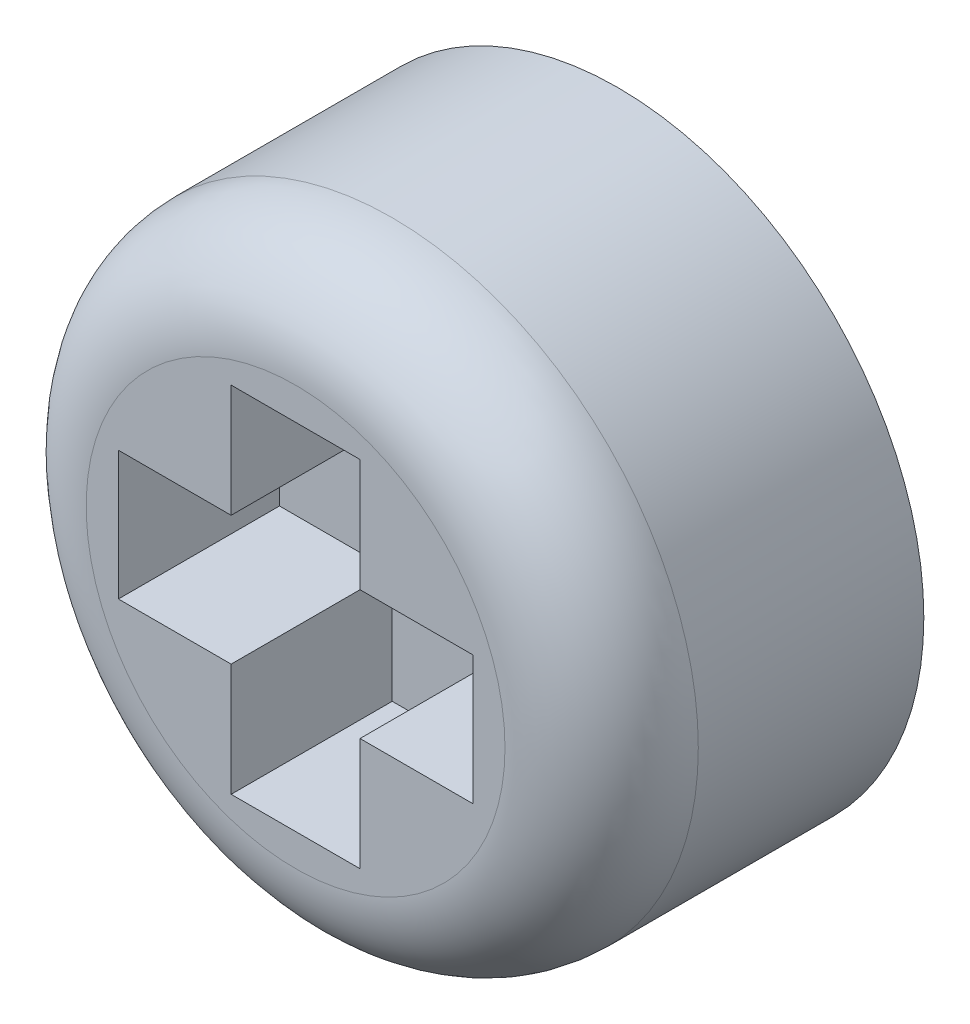
ISO-10303-21;
HEADER;
FILE_DESCRIPTION(('STEP AP214'),'2;1');
FILE_NAME('part.step','',(''),(''),'','','');
FILE_SCHEMA(('AUTOMOTIVE_DESIGN { 1 0 10303 214 1 1 1 1 }'));
ENDSEC;
DATA;
#1=APPLICATION_CONTEXT('core data for automotive mechanical design processes');
#2=APPLICATION_PROTOCOL_DEFINITION('international standard','automotive_design',2000,#1);
#3=PRODUCT_CONTEXT('',#1,'mechanical');
#4=PRODUCT('Part','Part','',(#3));
#5=PRODUCT_RELATED_PRODUCT_CATEGORY('part','',(#4));
#6=PRODUCT_DEFINITION_FORMATION('','',#4);
#7=PRODUCT_DEFINITION_CONTEXT('part definition',#1,'design');
#8=PRODUCT_DEFINITION('design','',#6,#7);
#9=PRODUCT_DEFINITION_SHAPE('','',#8);
#10=(LENGTH_UNIT() NAMED_UNIT(*) SI_UNIT(.MILLI.,.METRE.));
#11=(NAMED_UNIT(*) PLANE_ANGLE_UNIT() SI_UNIT($,.RADIAN.));
#12=(NAMED_UNIT(*) SI_UNIT($,.STERADIAN.) SOLID_ANGLE_UNIT());
#13=UNCERTAINTY_MEASURE_WITH_UNIT(LENGTH_MEASURE(1.E-05),#10,'distance_accuracy_value','');
#14=(GEOMETRIC_REPRESENTATION_CONTEXT(3) GLOBAL_UNCERTAINTY_ASSIGNED_CONTEXT((#13)) GLOBAL_UNIT_ASSIGNED_CONTEXT((#10,
#11,#12)) REPRESENTATION_CONTEXT('',''));
#15=CARTESIAN_POINT('',(0.,0.,0.));
#16=DIRECTION('',(0.,0.,1.));
#17=DIRECTION('',(1.,0.,0.));
#18=AXIS2_PLACEMENT_3D('',#15,#16,#17);
#19=CARTESIAN_POINT('',(0.,0.,2.54));
#20=DIRECTION('',(0.,0.,-1.));
#21=DIRECTION('',(-1.,0.,0.));
#22=AXIS2_PLACEMENT_3D('',#19,#20,#21);
#23=CYLINDRICAL_SURFACE('',#22,2.413);
#24=CARTESIAN_POINT('',(0.,0.,1.778));
#25=DIRECTION('',(0.,0.,1.));
#26=DIRECTION('',(1.,0.,0.));
#27=AXIS2_PLACEMENT_3D('',#24,#25,#26);
#28=CIRCLE('',#27,2.413);
#29=CARTESIAN_POINT('',(2.413,0.,1.778));
#30=VERTEX_POINT('',#29);
#31=EDGE_CURVE('E11',#30,#30,#28,.F.);
#32=ORIENTED_EDGE('',*,*,#31,.T.);
#33=EDGE_LOOP('',(#32));
#34=FACE_BOUND('',#33,.T.);
#35=CARTESIAN_POINT('',(0.,0.,0.));
#36=DIRECTION('',(0.,0.,1.));
#37=DIRECTION('',(1.,0.,0.));
#38=AXIS2_PLACEMENT_3D('',#35,#36,#37);
#39=CIRCLE('',#38,2.413);
#40=CARTESIAN_POINT('',(2.413,0.,0.));
#41=VERTEX_POINT('',#40);
#42=EDGE_CURVE('E188',#41,#41,#39,.T.);
#43=ORIENTED_EDGE('',*,*,#42,.T.);
#44=EDGE_LOOP('',(#43));
#45=FACE_BOUND('',#44,.T.);
#46=ADVANCED_FACE('F32',(#34,#45),#23,.T.);
#47=CARTESIAN_POINT('',(0.,0.,2.54));
#48=DIRECTION('',(0.,0.,1.));
#49=DIRECTION('',(1.,0.,0.));
#50=AXIS2_PLACEMENT_3D('',#47,#48,#49);
#51=PLANE('',#50);
#52=CARTESIAN_POINT('',(0.,0.,2.54));
#53=DIRECTION('',(0.,0.,1.));
#54=DIRECTION('',(1.,0.,0.));
#55=AXIS2_PLACEMENT_3D('',#52,#53,#54);
#56=CIRCLE('',#55,1.651);
#57=CARTESIAN_POINT('',(1.651,0.,2.54));
#58=VERTEX_POINT('',#57);
#59=EDGE_CURVE('E40',#58,#58,#56,.T.);
#60=ORIENTED_EDGE('',*,*,#59,.T.);
#61=EDGE_LOOP('',(#60));
#62=FACE_BOUND('',#61,.T.);
#63=DIRECTION('',(0.,-1.,0.));
#64=VECTOR('',#63,1.);
#65=CARTESIAN_POINT('',(-0.508,-1.397,2.54));
#66=LINE('',#65,#64);
#67=CARTESIAN_POINT('',(-0.508,-0.508,2.54));
#68=VERTEX_POINT('',#67);
#69=CARTESIAN_POINT('',(-0.508,-1.397,2.54));
#70=VERTEX_POINT('',#69);
#71=EDGE_CURVE('E47',#68,#70,#66,.T.);
#72=ORIENTED_EDGE('',*,*,#71,.F.);
#73=DIRECTION('',(1.,0.,0.));
#74=VECTOR('',#73,1.);
#75=CARTESIAN_POINT('',(-1.397,-0.508,2.54));
#76=LINE('',#75,#74);
#77=CARTESIAN_POINT('',(-1.397,-0.508,2.54));
#78=VERTEX_POINT('',#77);
#79=EDGE_CURVE('E184',#78,#68,#76,.T.);
#80=ORIENTED_EDGE('',*,*,#79,.F.);
#81=DIRECTION('',(0.,-1.,0.));
#82=VECTOR('',#81,1.);
#83=CARTESIAN_POINT('',(-1.397,-0.508,2.54));
#84=LINE('',#83,#82);
#85=CARTESIAN_POINT('',(-1.397,0.508,2.54));
#86=VERTEX_POINT('',#85);
#87=EDGE_CURVE('E182',#86,#78,#84,.T.);
#88=ORIENTED_EDGE('',*,*,#87,.F.);
#89=DIRECTION('',(-1.,0.,0.));
#90=VECTOR('',#89,1.);
#91=CARTESIAN_POINT('',(-1.397,0.508,2.54));
#92=LINE('',#91,#90);
#93=CARTESIAN_POINT('',(-0.508,0.508,2.54));
#94=VERTEX_POINT('',#93);
#95=EDGE_CURVE('E131',#94,#86,#92,.T.);
#96=ORIENTED_EDGE('',*,*,#95,.F.);
#97=DIRECTION('',(0.,-1.,0.));
#98=VECTOR('',#97,1.);
#99=CARTESIAN_POINT('',(-0.508,0.508,2.54));
#100=LINE('',#99,#98);
#101=CARTESIAN_POINT('',(-0.508,1.397,2.54));
#102=VERTEX_POINT('',#101);
#103=EDGE_CURVE('E178',#102,#94,#100,.T.);
#104=ORIENTED_EDGE('',*,*,#103,.F.);
#105=DIRECTION('',(-1.,0.,0.));
#106=VECTOR('',#105,1.);
#107=CARTESIAN_POINT('',(0.508,1.397,2.54));
#108=LINE('',#107,#106);
#109=CARTESIAN_POINT('',(0.508,1.397,2.54));
#110=VERTEX_POINT('',#109);
#111=EDGE_CURVE('E175',#110,#102,#108,.T.);
#112=ORIENTED_EDGE('',*,*,#111,.F.);
#113=DIRECTION('',(0.,1.,0.));
#114=VECTOR('',#113,1.);
#115=CARTESIAN_POINT('',(0.508,0.508,2.54));
#116=LINE('',#115,#114);
#117=CARTESIAN_POINT('',(0.508,0.508,2.54));
#118=VERTEX_POINT('',#117);
#119=EDGE_CURVE('E172',#118,#110,#116,.T.);
#120=ORIENTED_EDGE('',*,*,#119,.F.);
#121=DIRECTION('',(-1.,0.,0.));
#122=VECTOR('',#121,1.);
#123=CARTESIAN_POINT('',(0.508,0.508,2.54));
#124=LINE('',#123,#122);
#125=CARTESIAN_POINT('',(1.397,0.508,2.54));
#126=VERTEX_POINT('',#125);
#127=EDGE_CURVE('E169',#126,#118,#124,.T.);
#128=ORIENTED_EDGE('',*,*,#127,.F.);
#129=DIRECTION('',(0.,1.,0.));
#130=VECTOR('',#129,1.);
#131=CARTESIAN_POINT('',(1.397,-0.508,2.54));
#132=LINE('',#131,#130);
#133=CARTESIAN_POINT('',(1.397,-0.508,2.54));
#134=VERTEX_POINT('',#133);
#135=EDGE_CURVE('E166',#134,#126,#132,.T.);
#136=ORIENTED_EDGE('',*,*,#135,.F.);
#137=DIRECTION('',(1.,0.,0.));
#138=VECTOR('',#137,1.);
#139=CARTESIAN_POINT('',(0.508,-0.508,2.54));
#140=LINE('',#139,#138);
#141=CARTESIAN_POINT('',(0.508,-0.508,2.54));
#142=VERTEX_POINT('',#141);
#143=EDGE_CURVE('E163',#142,#134,#140,.T.);
#144=ORIENTED_EDGE('',*,*,#143,.F.);
#145=DIRECTION('',(0.,1.,0.));
#146=VECTOR('',#145,1.);
#147=CARTESIAN_POINT('',(0.508,-1.397,2.54));
#148=LINE('',#147,#146);
#149=CARTESIAN_POINT('',(0.508,-1.397,2.54));
#150=VERTEX_POINT('',#149);
#151=EDGE_CURVE('E160',#150,#142,#148,.T.);
#152=ORIENTED_EDGE('',*,*,#151,.F.);
#153=DIRECTION('',(1.,0.,0.));
#154=VECTOR('',#153,1.);
#155=CARTESIAN_POINT('',(-0.508,-1.397,2.54));
#156=LINE('',#155,#154);
#157=EDGE_CURVE('E157',#70,#150,#156,.T.);
#158=ORIENTED_EDGE('',*,*,#157,.F.);
#159=EDGE_LOOP('',(#72,#80,#88,#96,#104,#112,#120,#128,#136,#144,#152,#158));
#160=FACE_BOUND('',#159,.T.);
#161=ADVANCED_FACE('F210',(#62,#160),#51,.T.);
#162=CARTESIAN_POINT('',(0.,0.,0.));
#163=DIRECTION('',(0.,0.,1.));
#164=DIRECTION('',(1.,0.,0.));
#165=AXIS2_PLACEMENT_3D('',#162,#163,#164);
#166=PLANE('',#165);
#167=ORIENTED_EDGE('',*,*,#42,.F.);
#168=EDGE_LOOP('',(#167));
#169=FACE_BOUND('',#168,.T.);
#170=ADVANCED_FACE('F226',(#169),#166,.F.);
#171=CARTESIAN_POINT('',(-0.508,-1.397,1.27));
#172=DIRECTION('',(-1.,0.,0.));
#173=DIRECTION('',(0.,0.,1.));
#174=AXIS2_PLACEMENT_3D('',#171,#172,#173);
#175=PLANE('',#174);
#176=ORIENTED_EDGE('',*,*,#71,.T.);
#177=DIRECTION('',(0.,0.,1.));
#178=VECTOR('',#177,1.);
#179=CARTESIAN_POINT('',(-0.508,-1.397,1.27));
#180=LINE('',#179,#178);
#181=CARTESIAN_POINT('',(-0.508,-1.397,1.27));
#182=VERTEX_POINT('',#181);
#183=EDGE_CURVE('E95',#182,#70,#180,.T.);
#184=ORIENTED_EDGE('',*,*,#183,.F.);
#185=DIRECTION('',(0.,-1.,0.));
#186=VECTOR('',#185,1.);
#187=CARTESIAN_POINT('',(-0.508,-1.397,1.27));
#188=LINE('',#187,#186);
#189=CARTESIAN_POINT('',(-0.508,-0.508,1.27));
#190=VERTEX_POINT('',#189);
#191=EDGE_CURVE('E186',#190,#182,#188,.T.);
#192=ORIENTED_EDGE('',*,*,#191,.F.);
#193=DIRECTION('',(0.,0.,1.));
#194=VECTOR('',#193,1.);
#195=CARTESIAN_POINT('',(-0.508,-0.508,1.27));
#196=LINE('',#195,#194);
#197=EDGE_CURVE('E55',#190,#68,#196,.T.);
#198=ORIENTED_EDGE('',*,*,#197,.T.);
#199=EDGE_LOOP('',(#176,#184,#192,#198));
#200=FACE_BOUND('',#199,.T.);
#201=ADVANCED_FACE('F231',(#200),#175,.F.);
#202=CARTESIAN_POINT('',(-1.397,-0.508,1.27));
#203=DIRECTION('',(0.,-1.,0.));
#204=DIRECTION('',(0.,0.,-1.));
#205=AXIS2_PLACEMENT_3D('',#202,#203,#204);
#206=PLANE('',#205);
#207=ORIENTED_EDGE('',*,*,#79,.T.);
#208=ORIENTED_EDGE('',*,*,#197,.F.);
#209=DIRECTION('',(1.,0.,0.));
#210=VECTOR('',#209,1.);
#211=CARTESIAN_POINT('',(-1.397,-0.508,1.27));
#212=LINE('',#211,#210);
#213=CARTESIAN_POINT('',(-1.397,-0.508,1.27));
#214=VERTEX_POINT('',#213);
#215=EDGE_CURVE('E143',#214,#190,#212,.T.);
#216=ORIENTED_EDGE('',*,*,#215,.F.);
#217=DIRECTION('',(0.,0.,1.));
#218=VECTOR('',#217,1.);
#219=CARTESIAN_POINT('',(-1.397,-0.508,1.27));
#220=LINE('',#219,#218);
#221=EDGE_CURVE('E135',#214,#78,#220,.T.);
#222=ORIENTED_EDGE('',*,*,#221,.T.);
#223=EDGE_LOOP('',(#207,#208,#216,#222));
#224=FACE_BOUND('',#223,.T.);
#225=ADVANCED_FACE('F236',(#224),#206,.F.);
#226=CARTESIAN_POINT('',(-1.397,-0.508,1.27));
#227=DIRECTION('',(-1.,0.,0.));
#228=DIRECTION('',(0.,0.,1.));
#229=AXIS2_PLACEMENT_3D('',#226,#227,#228);
#230=PLANE('',#229);
#231=ORIENTED_EDGE('',*,*,#87,.T.);
#232=ORIENTED_EDGE('',*,*,#221,.F.);
#233=DIRECTION('',(0.,-1.,0.));
#234=VECTOR('',#233,1.);
#235=CARTESIAN_POINT('',(-1.397,-0.508,1.27));
#236=LINE('',#235,#234);
#237=CARTESIAN_POINT('',(-1.397,0.508,1.27));
#238=VERTEX_POINT('',#237);
#239=EDGE_CURVE('E139',#238,#214,#236,.T.);
#240=ORIENTED_EDGE('',*,*,#239,.F.);
#241=DIRECTION('',(0.,0.,1.));
#242=VECTOR('',#241,1.);
#243=CARTESIAN_POINT('',(-1.397,0.508,1.27));
#244=LINE('',#243,#242);
#245=EDGE_CURVE('E124',#238,#86,#244,.T.);
#246=ORIENTED_EDGE('',*,*,#245,.T.);
#247=EDGE_LOOP('',(#231,#232,#240,#246));
#248=FACE_BOUND('',#247,.T.);
#249=ADVANCED_FACE('F140',(#248),#230,.F.);
#250=CARTESIAN_POINT('',(-1.397,0.508,1.27));
#251=DIRECTION('',(0.,1.,0.));
#252=DIRECTION('',(0.,0.,1.));
#253=AXIS2_PLACEMENT_3D('',#250,#251,#252);
#254=PLANE('',#253);
#255=ORIENTED_EDGE('',*,*,#95,.T.);
#256=ORIENTED_EDGE('',*,*,#245,.F.);
#257=DIRECTION('',(-1.,0.,0.));
#258=VECTOR('',#257,1.);
#259=CARTESIAN_POINT('',(-1.397,0.508,1.27));
#260=LINE('',#259,#258);
#261=CARTESIAN_POINT('',(-0.508,0.508,1.27));
#262=VERTEX_POINT('',#261);
#263=EDGE_CURVE('E128',#262,#238,#260,.T.);
#264=ORIENTED_EDGE('',*,*,#263,.F.);
#265=DIRECTION('',(0.,0.,1.));
#266=VECTOR('',#265,1.);
#267=CARTESIAN_POINT('',(-0.508,0.508,1.27));
#268=LINE('',#267,#266);
#269=EDGE_CURVE('E136',#262,#94,#268,.T.);
#270=ORIENTED_EDGE('',*,*,#269,.T.);
#271=EDGE_LOOP('',(#255,#256,#264,#270));
#272=FACE_BOUND('',#271,.T.);
#273=ADVANCED_FACE('F126',(#272),#254,.F.);
#274=CARTESIAN_POINT('',(-0.508,0.508,1.27));
#275=DIRECTION('',(-1.,0.,0.));
#276=DIRECTION('',(0.,0.,1.));
#277=AXIS2_PLACEMENT_3D('',#274,#275,#276);
#278=PLANE('',#277);
#279=ORIENTED_EDGE('',*,*,#103,.T.);
#280=ORIENTED_EDGE('',*,*,#269,.F.);
#281=DIRECTION('',(0.,-1.,0.));
#282=VECTOR('',#281,1.);
#283=CARTESIAN_POINT('',(-0.508,0.508,1.27));
#284=LINE('',#283,#282);
#285=CARTESIAN_POINT('',(-0.508,1.397,1.27));
#286=VERTEX_POINT('',#285);
#287=EDGE_CURVE('E149',#286,#262,#284,.T.);
#288=ORIENTED_EDGE('',*,*,#287,.F.);
#289=DIRECTION('',(0.,0.,1.));
#290=VECTOR('',#289,1.);
#291=CARTESIAN_POINT('',(-0.508,1.397,1.27));
#292=LINE('',#291,#290);
#293=EDGE_CURVE('E191',#286,#102,#292,.T.);
#294=ORIENTED_EDGE('',*,*,#293,.T.);
#295=EDGE_LOOP('',(#279,#280,#288,#294));
#296=FACE_BOUND('',#295,.T.);
#297=ADVANCED_FACE('F263',(#296),#278,.F.);
#298=CARTESIAN_POINT('',(0.508,1.397,1.27));
#299=DIRECTION('',(0.,1.,0.));
#300=DIRECTION('',(0.,0.,1.));
#301=AXIS2_PLACEMENT_3D('',#298,#299,#300);
#302=PLANE('',#301);
#303=ORIENTED_EDGE('',*,*,#111,.T.);
#304=ORIENTED_EDGE('',*,*,#293,.F.);
#305=DIRECTION('',(-1.,0.,0.));
#306=VECTOR('',#305,1.);
#307=CARTESIAN_POINT('',(0.508,1.397,1.27));
#308=LINE('',#307,#306);
#309=CARTESIAN_POINT('',(0.508,1.397,1.27));
#310=VERTEX_POINT('',#309);
#311=EDGE_CURVE('E151',#310,#286,#308,.T.);
#312=ORIENTED_EDGE('',*,*,#311,.F.);
#313=DIRECTION('',(0.,0.,1.));
#314=VECTOR('',#313,1.);
#315=CARTESIAN_POINT('',(0.508,1.397,1.27));
#316=LINE('',#315,#314);
#317=EDGE_CURVE('E193',#310,#110,#316,.T.);
#318=ORIENTED_EDGE('',*,*,#317,.T.);
#319=EDGE_LOOP('',(#303,#304,#312,#318));
#320=FACE_BOUND('',#319,.T.);
#321=ADVANCED_FACE('F259',(#320),#302,.F.);
#322=CARTESIAN_POINT('',(0.508,0.508,1.27));
#323=DIRECTION('',(1.,0.,0.));
#324=DIRECTION('',(0.,0.,-1.));
#325=AXIS2_PLACEMENT_3D('',#322,#323,#324);
#326=PLANE('',#325);
#327=ORIENTED_EDGE('',*,*,#119,.T.);
#328=ORIENTED_EDGE('',*,*,#317,.F.);
#329=DIRECTION('',(0.,1.,0.));
#330=VECTOR('',#329,1.);
#331=CARTESIAN_POINT('',(0.508,0.508,1.27));
#332=LINE('',#331,#330);
#333=CARTESIAN_POINT('',(0.508,0.508,1.27));
#334=VERTEX_POINT('',#333);
#335=EDGE_CURVE('E297',#334,#310,#332,.T.);
#336=ORIENTED_EDGE('',*,*,#335,.F.);
#337=DIRECTION('',(0.,0.,1.));
#338=VECTOR('',#337,1.);
#339=CARTESIAN_POINT('',(0.508,0.508,1.27));
#340=LINE('',#339,#338);
#341=EDGE_CURVE('E195',#334,#118,#340,.T.);
#342=ORIENTED_EDGE('',*,*,#341,.T.);
#343=EDGE_LOOP('',(#327,#328,#336,#342));
#344=FACE_BOUND('',#343,.T.);
#345=ADVANCED_FACE('F255',(#344),#326,.F.);
#346=CARTESIAN_POINT('',(0.508,0.508,1.27));
#347=DIRECTION('',(0.,1.,0.));
#348=DIRECTION('',(0.,0.,1.));
#349=AXIS2_PLACEMENT_3D('',#346,#347,#348);
#350=PLANE('',#349);
#351=ORIENTED_EDGE('',*,*,#127,.T.);
#352=ORIENTED_EDGE('',*,*,#341,.F.);
#353=DIRECTION('',(-1.,0.,0.));
#354=VECTOR('',#353,1.);
#355=CARTESIAN_POINT('',(0.508,0.508,1.27));
#356=LINE('',#355,#354);
#357=CARTESIAN_POINT('',(1.397,0.508,1.27));
#358=VERTEX_POINT('',#357);
#359=EDGE_CURVE('E294',#358,#334,#356,.T.);
#360=ORIENTED_EDGE('',*,*,#359,.F.);
#361=DIRECTION('',(0.,0.,1.));
#362=VECTOR('',#361,1.);
#363=CARTESIAN_POINT('',(1.397,0.508,1.27));
#364=LINE('',#363,#362);
#365=EDGE_CURVE('E197',#358,#126,#364,.T.);
#366=ORIENTED_EDGE('',*,*,#365,.T.);
#367=EDGE_LOOP('',(#351,#352,#360,#366));
#368=FACE_BOUND('',#367,.T.);
#369=ADVANCED_FACE('F251',(#368),#350,.F.);
#370=CARTESIAN_POINT('',(1.397,-0.508,1.27));
#371=DIRECTION('',(1.,0.,0.));
#372=DIRECTION('',(0.,0.,-1.));
#373=AXIS2_PLACEMENT_3D('',#370,#371,#372);
#374=PLANE('',#373);
#375=ORIENTED_EDGE('',*,*,#135,.T.);
#376=ORIENTED_EDGE('',*,*,#365,.F.);
#377=DIRECTION('',(0.,1.,0.));
#378=VECTOR('',#377,1.);
#379=CARTESIAN_POINT('',(1.397,-0.508,1.27));
#380=LINE('',#379,#378);
#381=CARTESIAN_POINT('',(1.397,-0.508,1.27));
#382=VERTEX_POINT('',#381);
#383=EDGE_CURVE('E291',#382,#358,#380,.T.);
#384=ORIENTED_EDGE('',*,*,#383,.F.);
#385=DIRECTION('',(0.,0.,1.));
#386=VECTOR('',#385,1.);
#387=CARTESIAN_POINT('',(1.397,-0.508,1.27));
#388=LINE('',#387,#386);
#389=EDGE_CURVE('E199',#382,#134,#388,.T.);
#390=ORIENTED_EDGE('',*,*,#389,.T.);
#391=EDGE_LOOP('',(#375,#376,#384,#390));
#392=FACE_BOUND('',#391,.T.);
#393=ADVANCED_FACE('F247',(#392),#374,.F.);
#394=CARTESIAN_POINT('',(0.508,-0.508,1.27));
#395=DIRECTION('',(0.,-1.,0.));
#396=DIRECTION('',(0.,0.,-1.));
#397=AXIS2_PLACEMENT_3D('',#394,#395,#396);
#398=PLANE('',#397);
#399=ORIENTED_EDGE('',*,*,#143,.T.);
#400=ORIENTED_EDGE('',*,*,#389,.F.);
#401=DIRECTION('',(1.,0.,0.));
#402=VECTOR('',#401,1.);
#403=CARTESIAN_POINT('',(0.508,-0.508,1.27));
#404=LINE('',#403,#402);
#405=CARTESIAN_POINT('',(0.508,-0.508,1.27));
#406=VERTEX_POINT('',#405);
#407=EDGE_CURVE('E288',#406,#382,#404,.T.);
#408=ORIENTED_EDGE('',*,*,#407,.F.);
#409=DIRECTION('',(0.,0.,1.));
#410=VECTOR('',#409,1.);
#411=CARTESIAN_POINT('',(0.508,-0.508,1.27));
#412=LINE('',#411,#410);
#413=EDGE_CURVE('E201',#406,#142,#412,.T.);
#414=ORIENTED_EDGE('',*,*,#413,.T.);
#415=EDGE_LOOP('',(#399,#400,#408,#414));
#416=FACE_BOUND('',#415,.T.);
#417=ADVANCED_FACE('F243',(#416),#398,.F.);
#418=CARTESIAN_POINT('',(0.508,-1.397,1.27));
#419=DIRECTION('',(1.,0.,0.));
#420=DIRECTION('',(0.,0.,-1.));
#421=AXIS2_PLACEMENT_3D('',#418,#419,#420);
#422=PLANE('',#421);
#423=ORIENTED_EDGE('',*,*,#151,.T.);
#424=ORIENTED_EDGE('',*,*,#413,.F.);
#425=DIRECTION('',(0.,1.,0.));
#426=VECTOR('',#425,1.);
#427=CARTESIAN_POINT('',(0.508,-1.397,1.27));
#428=LINE('',#427,#426);
#429=CARTESIAN_POINT('',(0.508,-1.397,1.27));
#430=VERTEX_POINT('',#429);
#431=EDGE_CURVE('E283',#430,#406,#428,.T.);
#432=ORIENTED_EDGE('',*,*,#431,.F.);
#433=DIRECTION('',(0.,0.,1.));
#434=VECTOR('',#433,1.);
#435=CARTESIAN_POINT('',(0.508,-1.397,1.27));
#436=LINE('',#435,#434);
#437=EDGE_CURVE('E203',#430,#150,#436,.T.);
#438=ORIENTED_EDGE('',*,*,#437,.T.);
#439=EDGE_LOOP('',(#423,#424,#432,#438));
#440=FACE_BOUND('',#439,.T.);
#441=ADVANCED_FACE('F239',(#440),#422,.F.);
#442=CARTESIAN_POINT('',(-0.508,-1.397,1.27));
#443=DIRECTION('',(0.,-1.,0.));
#444=DIRECTION('',(0.,0.,-1.));
#445=AXIS2_PLACEMENT_3D('',#442,#443,#444);
#446=PLANE('',#445);
#447=ORIENTED_EDGE('',*,*,#157,.T.);
#448=ORIENTED_EDGE('',*,*,#437,.F.);
#449=DIRECTION('',(1.,0.,0.));
#450=VECTOR('',#449,1.);
#451=CARTESIAN_POINT('',(-0.508,-1.397,1.27));
#452=LINE('',#451,#450);
#453=EDGE_CURVE('E281',#182,#430,#452,.T.);
#454=ORIENTED_EDGE('',*,*,#453,.F.);
#455=ORIENTED_EDGE('',*,*,#183,.T.);
#456=EDGE_LOOP('',(#447,#448,#454,#455));
#457=FACE_BOUND('',#456,.T.);
#458=ADVANCED_FACE('F218',(#457),#446,.F.);
#459=CARTESIAN_POINT('',(0.,0.,1.27));
#460=DIRECTION('',(0.,0.,-1.));
#461=DIRECTION('',(-1.,0.,0.));
#462=AXIS2_PLACEMENT_3D('',#459,#460,#461);
#463=PLANE('',#462);
#464=ORIENTED_EDGE('',*,*,#191,.T.);
#465=ORIENTED_EDGE('',*,*,#453,.T.);
#466=ORIENTED_EDGE('',*,*,#431,.T.);
#467=ORIENTED_EDGE('',*,*,#407,.T.);
#468=ORIENTED_EDGE('',*,*,#383,.T.);
#469=ORIENTED_EDGE('',*,*,#359,.T.);
#470=ORIENTED_EDGE('',*,*,#335,.T.);
#471=ORIENTED_EDGE('',*,*,#311,.T.);
#472=ORIENTED_EDGE('',*,*,#287,.T.);
#473=ORIENTED_EDGE('',*,*,#263,.T.);
#474=ORIENTED_EDGE('',*,*,#239,.T.);
#475=ORIENTED_EDGE('',*,*,#215,.T.);
#476=EDGE_LOOP('',(#464,#465,#466,#467,#468,#469,#470,#471,#472,#473,#474,#475));
#477=FACE_BOUND('',#476,.T.);
#478=ADVANCED_FACE('F146',(#477),#463,.F.);
#479=CARTESIAN_POINT('',(0.,0.,1.778));
#480=DIRECTION('',(0.,0.,1.));
#481=DIRECTION('',(1.,0.,0.));
#482=AXIS2_PLACEMENT_3D('',#479,#480,#481);
#483=TOROIDAL_SURFACE('',#482,1.651,0.762);
#484=ORIENTED_EDGE('',*,*,#31,.F.);
#485=EDGE_LOOP('',(#484));
#486=FACE_BOUND('',#485,.T.);
#487=ORIENTED_EDGE('',*,*,#59,.F.);
#488=EDGE_LOOP('',(#487));
#489=FACE_BOUND('',#488,.T.);
#490=ADVANCED_FACE('F34',(#486,#489),#483,.T.);
#491=CLOSED_SHELL('',(#46,#161,#170,#201,#225,#249,#273,#297,#321,#345,#369,#393,#417,#441,#458,
#478,#490));
#492=MANIFOLD_SOLID_BREP('B2',#491);
#493=ADVANCED_BREP_SHAPE_REPRESENTATION('',(#18,#492),#14);
#494=SHAPE_DEFINITION_REPRESENTATION(#9,#493);
ENDSEC;
END-ISO-10303-21;
